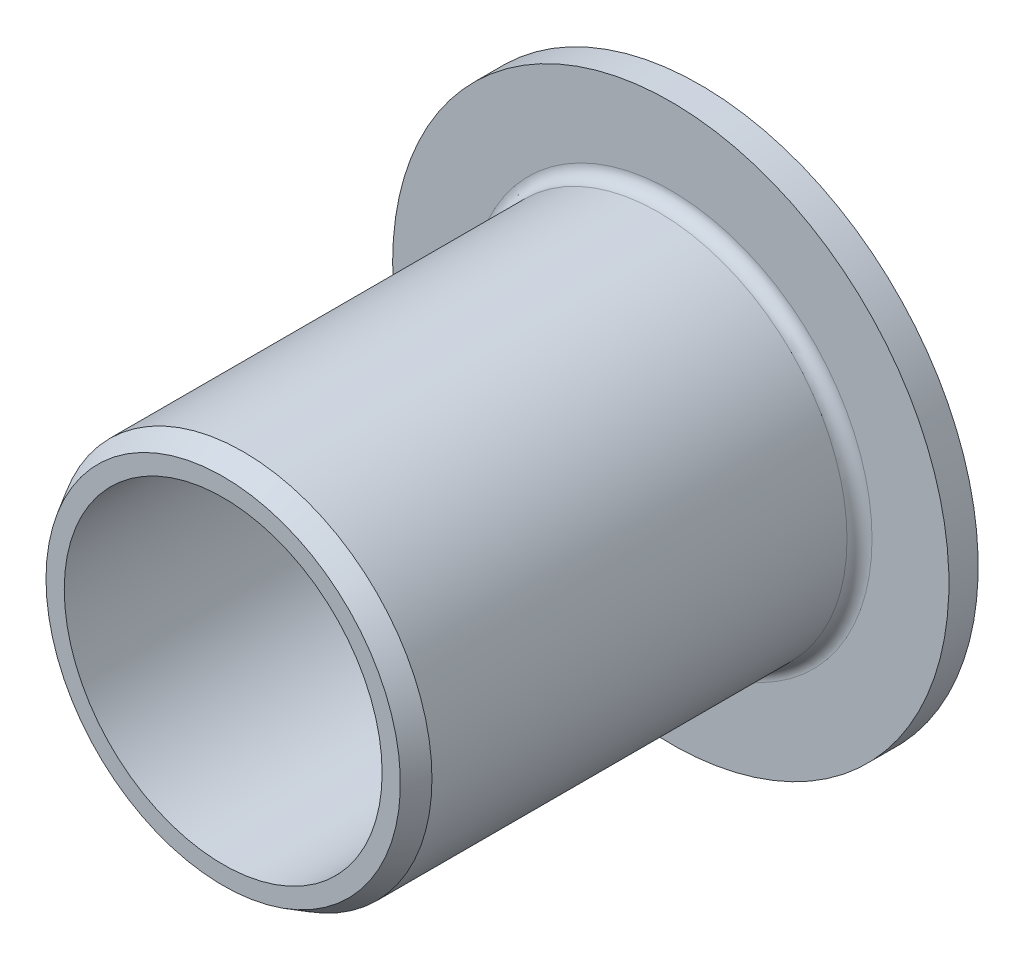
ISO-10303-21;
HEADER;
FILE_DESCRIPTION(('STEP AP214'),'2;1');
FILE_NAME('part.step','',(''),(''),'','','');
FILE_SCHEMA(('AUTOMOTIVE_DESIGN { 1 0 10303 214 1 1 1 1 }'));
ENDSEC;
DATA;
#1=APPLICATION_CONTEXT('core data for automotive mechanical design processes');
#2=APPLICATION_PROTOCOL_DEFINITION('international standard','automotive_design',2000,#1);
#3=PRODUCT_CONTEXT('',#1,'mechanical');
#4=PRODUCT('Part','Part','',(#3));
#5=PRODUCT_RELATED_PRODUCT_CATEGORY('part','',(#4));
#6=PRODUCT_DEFINITION_FORMATION('','',#4);
#7=PRODUCT_DEFINITION_CONTEXT('part definition',#1,'design');
#8=PRODUCT_DEFINITION('design','',#6,#7);
#9=PRODUCT_DEFINITION_SHAPE('','',#8);
#10=(LENGTH_UNIT() NAMED_UNIT(*) SI_UNIT(.MILLI.,.METRE.));
#11=(NAMED_UNIT(*) PLANE_ANGLE_UNIT() SI_UNIT($,.RADIAN.));
#12=(NAMED_UNIT(*) SI_UNIT($,.STERADIAN.) SOLID_ANGLE_UNIT());
#13=UNCERTAINTY_MEASURE_WITH_UNIT(LENGTH_MEASURE(1.E-05),#10,'distance_accuracy_value','');
#14=(GEOMETRIC_REPRESENTATION_CONTEXT(3) GLOBAL_UNCERTAINTY_ASSIGNED_CONTEXT((#13)) GLOBAL_UNIT_ASSIGNED_CONTEXT((#10,
#11,#12)) REPRESENTATION_CONTEXT('',''));
#15=CARTESIAN_POINT('',(0.,0.,0.));
#16=DIRECTION('',(0.,0.,1.));
#17=DIRECTION('',(1.,0.,0.));
#18=AXIS2_PLACEMENT_3D('',#15,#16,#17);
#19=CARTESIAN_POINT('',(8.73125,0.,0.));
#20=DIRECTION('',(0.,0.,-1.));
#21=DIRECTION('',(-1.,0.,0.));
#22=AXIS2_PLACEMENT_3D('',#19,#20,#21);
#23=PLANE('',#22);
#24=CARTESIAN_POINT('',(0.,0.,0.));
#25=DIRECTION('',(0.,0.,-1.));
#26=DIRECTION('',(-1.,0.,0.));
#27=AXIS2_PLACEMENT_3D('',#24,#25,#26);
#28=CIRCLE('',#27,6.35);
#29=CARTESIAN_POINT('',(-6.35,0.,0.));
#30=VERTEX_POINT('',#29);
#31=EDGE_CURVE('E113',#30,#30,#28,.F.);
#32=ORIENTED_EDGE('',*,*,#31,.T.);
#33=EDGE_LOOP('',(#32));
#34=FACE_BOUND('',#33,.T.);
#35=CARTESIAN_POINT('',(0.,0.,0.));
#36=DIRECTION('',(0.,0.,-1.));
#37=DIRECTION('',(-1.,0.,0.));
#38=AXIS2_PLACEMENT_3D('',#35,#36,#37);
#39=CIRCLE('',#38,11.1125);
#40=CARTESIAN_POINT('',(-11.1125,0.,0.));
#41=VERTEX_POINT('',#40);
#42=EDGE_CURVE('E116',#41,#41,#39,.F.);
#43=ORIENTED_EDGE('',*,*,#42,.F.);
#44=EDGE_LOOP('',(#43));
#45=FACE_BOUND('',#44,.T.);
#46=ADVANCED_FACE('F14',(#34,#45),#23,.T.);
#47=CARTESIAN_POINT('',(0.,0.,0.5842));
#48=DIRECTION('',(0.,0.,-1.));
#49=DIRECTION('',(-1.,0.,0.));
#50=AXIS2_PLACEMENT_3D('',#47,#48,#49);
#51=CYLINDRICAL_SURFACE('',#50,11.1125);
#52=CARTESIAN_POINT('',(0.,0.,1.1684));
#53=DIRECTION('',(0.,0.,-1.));
#54=DIRECTION('',(-1.,0.,0.));
#55=AXIS2_PLACEMENT_3D('',#52,#53,#54);
#56=CIRCLE('',#55,11.1125);
#57=CARTESIAN_POINT('',(-11.1125,0.,1.1684));
#58=VERTEX_POINT('',#57);
#59=EDGE_CURVE('E39',#58,#58,#56,.F.);
#60=ORIENTED_EDGE('',*,*,#59,.F.);
#61=EDGE_LOOP('',(#60));
#62=FACE_BOUND('',#61,.T.);
#63=ORIENTED_EDGE('',*,*,#42,.T.);
#64=EDGE_LOOP('',(#63));
#65=FACE_BOUND('',#64,.T.);
#66=ADVANCED_FACE('F83',(#62,#65),#51,.T.);
#67=CARTESIAN_POINT('',(0.,0.,9.525));
#68=DIRECTION('',(0.,0.,-1.));
#69=DIRECTION('',(-1.,0.,0.));
#70=AXIS2_PLACEMENT_3D('',#67,#68,#69);
#71=CYLINDRICAL_SURFACE('',#70,6.35);
#72=ORIENTED_EDGE('',*,*,#31,.F.);
#73=EDGE_LOOP('',(#72));
#74=FACE_BOUND('',#73,.T.);
#75=CARTESIAN_POINT('',(0.,0.,19.05));
#76=DIRECTION('',(0.,0.,-1.));
#77=DIRECTION('',(-1.,0.,0.));
#78=AXIS2_PLACEMENT_3D('',#75,#76,#77);
#79=CIRCLE('',#78,6.35);
#80=CARTESIAN_POINT('',(-6.35,0.,19.05));
#81=VERTEX_POINT('',#80);
#82=EDGE_CURVE('E38',#81,#81,#79,.T.);
#83=ORIENTED_EDGE('',*,*,#82,.F.);
#84=EDGE_LOOP('',(#83));
#85=FACE_BOUND('',#84,.T.);
#86=ADVANCED_FACE('F79',(#74,#85),#71,.F.);
#87=CARTESIAN_POINT('',(9.5765625,0.,1.1684));
#88=DIRECTION('',(0.,0.,1.));
#89=DIRECTION('',(1.,0.,0.));
#90=AXIS2_PLACEMENT_3D('',#87,#88,#89);
#91=PLANE('',#90);
#92=ORIENTED_EDGE('',*,*,#59,.T.);
#93=EDGE_LOOP('',(#92));
#94=FACE_BOUND('',#93,.T.);
#95=CARTESIAN_POINT('',(0.,0.,1.1684));
#96=DIRECTION('',(0.,0.,1.));
#97=DIRECTION('',(1.,0.,0.));
#98=AXIS2_PLACEMENT_3D('',#95,#96,#97);
#99=CIRCLE('',#98,8.040625);
#100=CARTESIAN_POINT('',(-8.040625,0.,1.1684));
#101=VERTEX_POINT('',#100);
#102=CARTESIAN_POINT('',(8.040625,0.,1.1684));
#103=VERTEX_POINT('',#102);
#104=EDGE_CURVE('E31',#101,#103,#99,.F.);
#105=ORIENTED_EDGE('',*,*,#104,.T.);
#106=CARTESIAN_POINT('',(0.,0.,1.1684));
#107=DIRECTION('',(0.,0.,1.));
#108=DIRECTION('',(-1.,0.,0.));
#109=AXIS2_PLACEMENT_3D('',#106,#107,#108);
#110=CIRCLE('',#109,8.040625);
#111=EDGE_CURVE('E34',#103,#101,#110,.F.);
#112=ORIENTED_EDGE('',*,*,#111,.T.);
#113=EDGE_LOOP('',(#105,#112));
#114=FACE_BOUND('',#113,.T.);
#115=ADVANCED_FACE('F36',(#94,#114),#91,.T.);
#116=CARTESIAN_POINT('',(6.71437239232415,0.,19.05));
#117=DIRECTION('',(0.,0.,1.));
#118=DIRECTION('',(1.,0.,0.));
#119=AXIS2_PLACEMENT_3D('',#116,#117,#118);
#120=PLANE('',#119);
#121=CARTESIAN_POINT('',(0.,0.,19.05));
#122=DIRECTION('',(0.,0.,-1.));
#123=DIRECTION('',(-1.,0.,0.));
#124=AXIS2_PLACEMENT_3D('',#121,#122,#123);
#125=CIRCLE('',#124,7.0787447846483);
#126=CARTESIAN_POINT('',(-7.0787447846483,0.,19.05));
#127=VERTEX_POINT('',#126);
#128=EDGE_CURVE('E44',#127,#127,#125,.T.);
#129=ORIENTED_EDGE('',*,*,#128,.F.);
#130=EDGE_LOOP('',(#129));
#131=FACE_BOUND('',#130,.T.);
#132=ORIENTED_EDGE('',*,*,#82,.T.);
#133=EDGE_LOOP('',(#132));
#134=FACE_BOUND('',#133,.T.);
#135=ADVANCED_FACE('F63',(#131,#134),#120,.T.);
#136=CARTESIAN_POINT('',(0.,0.,1.6684));
#137=DIRECTION('',(0.,0.,1.));
#138=DIRECTION('',(1.,0.,0.));
#139=AXIS2_PLACEMENT_3D('',#136,#137,#138);
#140=TOROIDAL_SURFACE('',#139,8.040625,0.5);
#141=CARTESIAN_POINT('',(0.,0.,1.6684));
#142=DIRECTION('',(0.,0.,-1.));
#143=DIRECTION('',(-1.,0.,0.));
#144=AXIS2_PLACEMENT_3D('',#141,#142,#143);
#145=CIRCLE('',#144,7.540625);
#146=CARTESIAN_POINT('',(-7.540625,0.,1.6684));
#147=VERTEX_POINT('',#146);
#148=EDGE_CURVE('E24',#147,#147,#145,.F.);
#149=ORIENTED_EDGE('',*,*,#148,.F.);
#150=EDGE_LOOP('',(#149));
#151=FACE_BOUND('',#150,.T.);
#152=ORIENTED_EDGE('',*,*,#111,.F.);
#153=ORIENTED_EDGE('',*,*,#104,.F.);
#154=EDGE_LOOP('',(#152,#153));
#155=FACE_BOUND('',#154,.T.);
#156=ADVANCED_FACE('F43',(#151,#155),#140,.F.);
#157=CARTESIAN_POINT('',(0.,0.,18.25));
#158=DIRECTION('',(0.,0.,-1.));
#159=DIRECTION('',(-1.,0.,0.));
#160=AXIS2_PLACEMENT_3D('',#157,#158,#159);
#161=CONICAL_SURFACE('',#160,7.540625,0.523598775598299);
#162=ORIENTED_EDGE('',*,*,#128,.T.);
#163=EDGE_LOOP('',(#162));
#164=FACE_BOUND('',#163,.T.);
#165=CARTESIAN_POINT('',(0.,0.,18.25));
#166=DIRECTION('',(0.,0.,-1.));
#167=DIRECTION('',(-1.,0.,0.));
#168=AXIS2_PLACEMENT_3D('',#165,#166,#167);
#169=CIRCLE('',#168,7.540625);
#170=CARTESIAN_POINT('',(-7.540625,0.,18.25));
#171=VERTEX_POINT('',#170);
#172=EDGE_CURVE('E9',#171,#171,#169,.T.);
#173=ORIENTED_EDGE('',*,*,#172,.F.);
#174=EDGE_LOOP('',(#173));
#175=FACE_BOUND('',#174,.T.);
#176=ADVANCED_FACE('F62',(#164,#175),#161,.T.);
#177=CARTESIAN_POINT('',(0.,0.,9.9592));
#178=DIRECTION('',(0.,0.,-1.));
#179=DIRECTION('',(-1.,0.,0.));
#180=AXIS2_PLACEMENT_3D('',#177,#178,#179);
#181=CYLINDRICAL_SURFACE('',#180,7.540625);
#182=ORIENTED_EDGE('',*,*,#148,.T.);
#183=EDGE_LOOP('',(#182));
#184=FACE_BOUND('',#183,.T.);
#185=ORIENTED_EDGE('',*,*,#172,.T.);
#186=EDGE_LOOP('',(#185));
#187=FACE_BOUND('',#186,.T.);
#188=ADVANCED_FACE('F94',(#184,#187),#181,.T.);
#189=CLOSED_SHELL('',(#46,#66,#86,#115,#135,#156,#176,#188));
#190=MANIFOLD_SOLID_BREP('B1',#189);
#191=ADVANCED_BREP_SHAPE_REPRESENTATION('',(#18,#190),#14);
#192=SHAPE_DEFINITION_REPRESENTATION(#9,#191);
ENDSEC;
END-ISO-10303-21;
